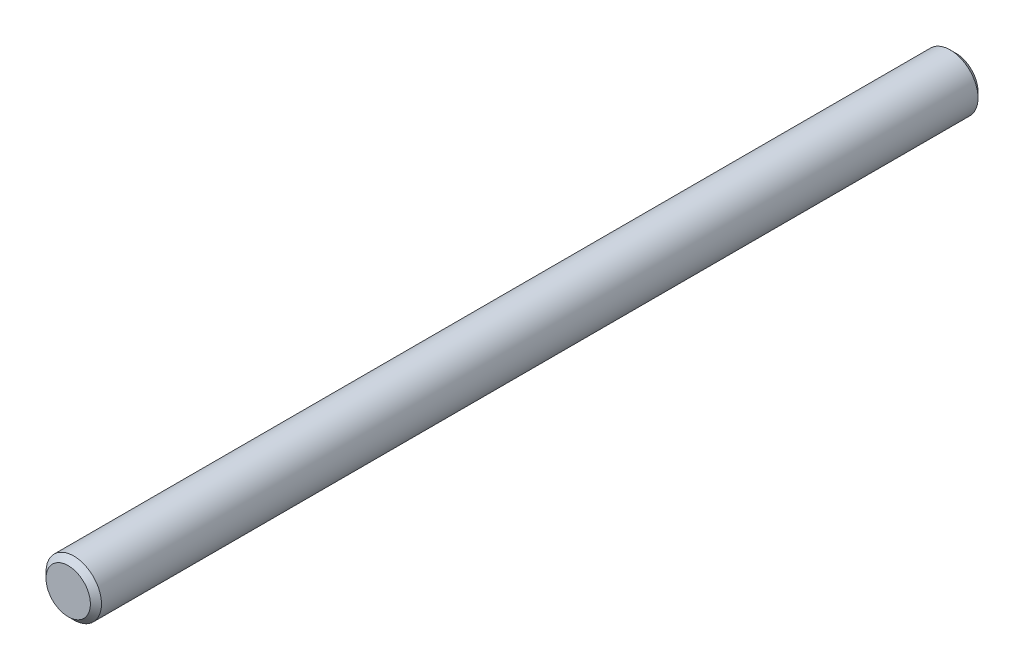
ISO-10303-21;
HEADER;
FILE_DESCRIPTION(('STEP AP214'),'2;1');
FILE_NAME('part.step','',(''),(''),'','','');
FILE_SCHEMA(('AUTOMOTIVE_DESIGN { 1 0 10303 214 1 1 1 1 }'));
ENDSEC;
DATA;
#1=APPLICATION_CONTEXT('core data for automotive mechanical design processes');
#2=APPLICATION_PROTOCOL_DEFINITION('international standard','automotive_design',2000,#1);
#3=PRODUCT_CONTEXT('',#1,'mechanical');
#4=PRODUCT('Part','Part','',(#3));
#5=PRODUCT_RELATED_PRODUCT_CATEGORY('part','',(#4));
#6=PRODUCT_DEFINITION_FORMATION('','',#4);
#7=PRODUCT_DEFINITION_CONTEXT('part definition',#1,'design');
#8=PRODUCT_DEFINITION('design','',#6,#7);
#9=PRODUCT_DEFINITION_SHAPE('','',#8);
#10=(LENGTH_UNIT() NAMED_UNIT(*) SI_UNIT(.MILLI.,.METRE.));
#11=(NAMED_UNIT(*) PLANE_ANGLE_UNIT() SI_UNIT($,.RADIAN.));
#12=(NAMED_UNIT(*) SI_UNIT($,.STERADIAN.) SOLID_ANGLE_UNIT());
#13=UNCERTAINTY_MEASURE_WITH_UNIT(LENGTH_MEASURE(1.E-05),#10,'distance_accuracy_value','');
#14=(GEOMETRIC_REPRESENTATION_CONTEXT(3) GLOBAL_UNCERTAINTY_ASSIGNED_CONTEXT((#13)) GLOBAL_UNIT_ASSIGNED_CONTEXT((#10,
#11,#12)) REPRESENTATION_CONTEXT('',''));
#15=CARTESIAN_POINT('',(0.,0.,0.));
#16=DIRECTION('',(0.,0.,1.));
#17=DIRECTION('',(1.,0.,0.));
#18=AXIS2_PLACEMENT_3D('',#15,#16,#17);
#19=CARTESIAN_POINT('',(0.,0.,152.4));
#20=DIRECTION('',(0.,0.,-1.));
#21=DIRECTION('',(-1.,0.,0.));
#22=AXIS2_PLACEMENT_3D('',#19,#20,#21);
#23=CYLINDRICAL_SURFACE('',#22,9.525);
#24=CARTESIAN_POINT('',(0.,0.,-150.495));
#25=DIRECTION('',(0.,0.,1.));
#26=DIRECTION('',(1.,0.,0.));
#27=AXIS2_PLACEMENT_3D('',#24,#25,#26);
#28=CIRCLE('',#27,9.525);
#29=CARTESIAN_POINT('',(9.525,0.,-150.495));
#30=VERTEX_POINT('',#29);
#31=EDGE_CURVE('E45',#30,#30,#28,.T.);
#32=ORIENTED_EDGE('',*,*,#31,.T.);
#33=EDGE_LOOP('',(#32));
#34=FACE_BOUND('',#33,.T.);
#35=CARTESIAN_POINT('',(0.,0.,150.495));
#36=DIRECTION('',(0.,0.,1.));
#37=DIRECTION('',(1.,0.,0.));
#38=AXIS2_PLACEMENT_3D('',#35,#36,#37);
#39=CIRCLE('',#38,9.525);
#40=CARTESIAN_POINT('',(9.525,0.,150.495));
#41=VERTEX_POINT('',#40);
#42=EDGE_CURVE('E49',#41,#41,#39,.F.);
#43=ORIENTED_EDGE('',*,*,#42,.T.);
#44=EDGE_LOOP('',(#43));
#45=FACE_BOUND('',#44,.T.);
#46=ADVANCED_FACE('F34',(#34,#45),#23,.T.);
#47=CARTESIAN_POINT('',(0.,0.,152.4));
#48=DIRECTION('',(0.,0.,1.));
#49=DIRECTION('',(1.,0.,0.));
#50=AXIS2_PLACEMENT_3D('',#47,#48,#49);
#51=PLANE('',#50);
#52=CARTESIAN_POINT('',(0.,0.,152.4));
#53=DIRECTION('',(0.,0.,1.));
#54=DIRECTION('',(1.,0.,0.));
#55=AXIS2_PLACEMENT_3D('',#52,#53,#54);
#56=CIRCLE('',#55,7.6200000000001);
#57=CARTESIAN_POINT('',(7.6200000000001,0.,152.4));
#58=VERTEX_POINT('',#57);
#59=EDGE_CURVE('E10',#58,#58,#56,.T.);
#60=ORIENTED_EDGE('',*,*,#59,.T.);
#61=EDGE_LOOP('',(#60));
#62=FACE_BOUND('',#61,.T.);
#63=ADVANCED_FACE('F65',(#62),#51,.T.);
#64=CARTESIAN_POINT('',(0.,0.,-152.4));
#65=DIRECTION('',(0.,0.,1.));
#66=DIRECTION('',(1.,0.,0.));
#67=AXIS2_PLACEMENT_3D('',#64,#65,#66);
#68=PLANE('',#67);
#69=CARTESIAN_POINT('',(0.,0.,-152.4));
#70=DIRECTION('',(0.,0.,1.));
#71=DIRECTION('',(1.,0.,0.));
#72=AXIS2_PLACEMENT_3D('',#69,#70,#71);
#73=CIRCLE('',#72,7.61999999999971);
#74=CARTESIAN_POINT('',(7.61999999999971,0.,-152.4));
#75=VERTEX_POINT('',#74);
#76=EDGE_CURVE('E41',#75,#75,#73,.F.);
#77=ORIENTED_EDGE('',*,*,#76,.T.);
#78=EDGE_LOOP('',(#77));
#79=FACE_BOUND('',#78,.T.);
#80=ADVANCED_FACE('F62',(#79),#68,.F.);
#81=CARTESIAN_POINT('',(0.,0.,-150.495));
#82=DIRECTION('',(0.,0.,1.));
#83=DIRECTION('',(1.,0.,0.));
#84=AXIS2_PLACEMENT_3D('',#81,#82,#83);
#85=CONICAL_SURFACE('',#84,9.525,0.78539816339744);
#86=ORIENTED_EDGE('',*,*,#76,.F.);
#87=EDGE_LOOP('',(#86));
#88=FACE_BOUND('',#87,.T.);
#89=ORIENTED_EDGE('',*,*,#31,.F.);
#90=EDGE_LOOP('',(#89));
#91=FACE_BOUND('',#90,.T.);
#92=ADVANCED_FACE('F58',(#88,#91),#85,.T.);
#93=CARTESIAN_POINT('',(0.,0.,152.4));
#94=DIRECTION('',(0.,0.,-1.));
#95=DIRECTION('',(-1.,0.,0.));
#96=AXIS2_PLACEMENT_3D('',#93,#94,#95);
#97=CONICAL_SURFACE('',#96,7.6200000000001,0.785398163397447);
#98=ORIENTED_EDGE('',*,*,#42,.F.);
#99=EDGE_LOOP('',(#98));
#100=FACE_BOUND('',#99,.T.);
#101=ORIENTED_EDGE('',*,*,#59,.F.);
#102=EDGE_LOOP('',(#101));
#103=FACE_BOUND('',#102,.T.);
#104=ADVANCED_FACE('F36',(#100,#103),#97,.T.);
#105=CLOSED_SHELL('',(#46,#63,#80,#92,#104));
#106=MANIFOLD_SOLID_BREP('B2',#105);
#107=ADVANCED_BREP_SHAPE_REPRESENTATION('',(#18,#106),#14);
#108=SHAPE_DEFINITION_REPRESENTATION(#9,#107);
ENDSEC;
END-ISO-10303-21;
